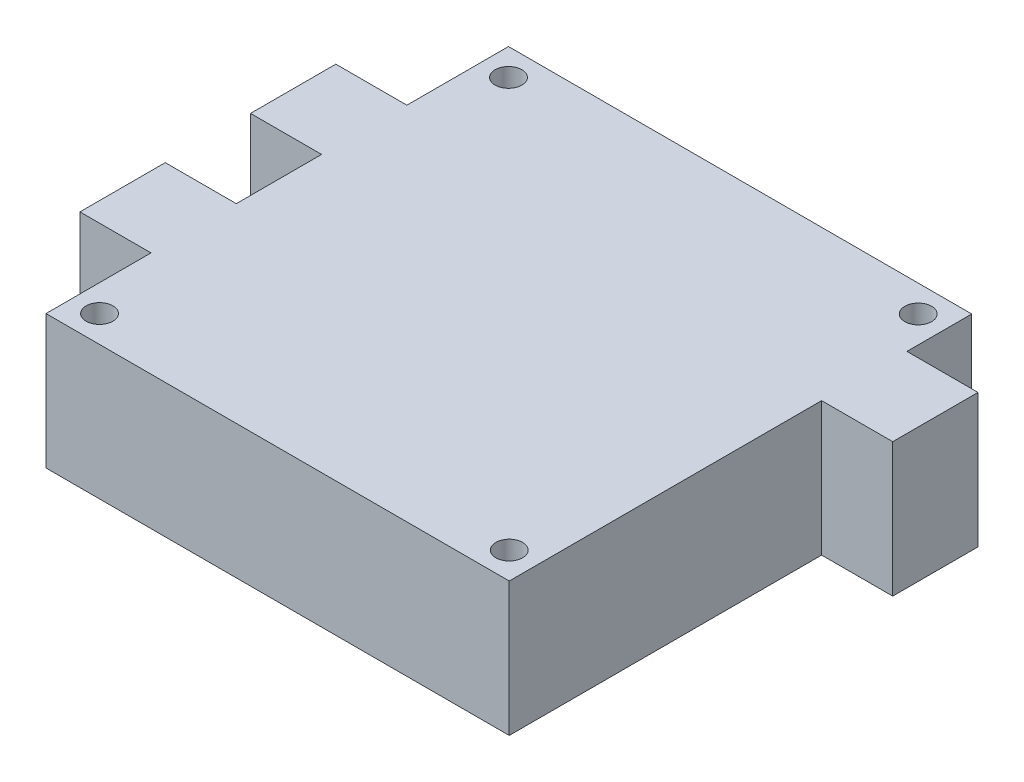
ISO-10303-21;
HEADER;
FILE_DESCRIPTION(('STEP AP214'),'2;1');
FILE_NAME('part.step','',(''),(''),'','','');
FILE_SCHEMA(('AUTOMOTIVE_DESIGN { 1 0 10303 214 1 1 1 1 }'));
ENDSEC;
DATA;
#1=APPLICATION_CONTEXT('core data for automotive mechanical design processes');
#2=APPLICATION_PROTOCOL_DEFINITION('international standard','automotive_design',2000,#1);
#3=PRODUCT_CONTEXT('',#1,'mechanical');
#4=PRODUCT('Part','Part','',(#3));
#5=PRODUCT_RELATED_PRODUCT_CATEGORY('part','',(#4));
#6=PRODUCT_DEFINITION_FORMATION('','',#4);
#7=PRODUCT_DEFINITION_CONTEXT('part definition',#1,'design');
#8=PRODUCT_DEFINITION('design','',#6,#7);
#9=PRODUCT_DEFINITION_SHAPE('','',#8);
#10=(LENGTH_UNIT() NAMED_UNIT(*) SI_UNIT(.MILLI.,.METRE.));
#11=(NAMED_UNIT(*) PLANE_ANGLE_UNIT() SI_UNIT($,.RADIAN.));
#12=(NAMED_UNIT(*) SI_UNIT($,.STERADIAN.) SOLID_ANGLE_UNIT());
#13=UNCERTAINTY_MEASURE_WITH_UNIT(LENGTH_MEASURE(1.E-05),#10,'distance_accuracy_value','');
#14=(GEOMETRIC_REPRESENTATION_CONTEXT(3) GLOBAL_UNCERTAINTY_ASSIGNED_CONTEXT((#13)) GLOBAL_UNIT_ASSIGNED_CONTEXT((#10,
#11,#12)) REPRESENTATION_CONTEXT('',''));
#15=CARTESIAN_POINT('',(0.,0.,0.));
#16=DIRECTION('',(0.,0.,1.));
#17=DIRECTION('',(1.,0.,0.));
#18=AXIS2_PLACEMENT_3D('',#15,#16,#17);
#19=CARTESIAN_POINT('',(0.,16.,0.));
#20=DIRECTION('',(0.,1.,0.));
#21=DIRECTION('',(0.,0.,1.));
#22=AXIS2_PLACEMENT_3D('',#19,#20,#21);
#23=PLANE('',#22);
#24=CARTESIAN_POINT('',(-24.5,16.,24.455));
#25=DIRECTION('',(0.,1.,0.));
#26=DIRECTION('',(0.,0.,1.));
#27=AXIS2_PLACEMENT_3D('',#24,#25,#26);
#28=CIRCLE('',#27,1.6);
#29=CARTESIAN_POINT('',(-24.5,16.,26.055));
#30=VERTEX_POINT('',#29);
#31=EDGE_CURVE('E346',#30,#30,#28,.T.);
#32=ORIENTED_EDGE('',*,*,#31,.F.);
#33=EDGE_LOOP('',(#32));
#34=FACE_BOUND('',#33,.T.);
#35=CARTESIAN_POINT('',(-24.5,16.,-24.455));
#36=DIRECTION('',(0.,1.,0.));
#37=DIRECTION('',(0.,0.,1.));
#38=AXIS2_PLACEMENT_3D('',#35,#36,#37);
#39=CIRCLE('',#38,1.6);
#40=CARTESIAN_POINT('',(-24.5,16.,-22.855));
#41=VERTEX_POINT('',#40);
#42=EDGE_CURVE('E185',#41,#41,#39,.T.);
#43=ORIENTED_EDGE('',*,*,#42,.F.);
#44=EDGE_LOOP('',(#43));
#45=FACE_BOUND('',#44,.T.);
#46=DIRECTION('',(0.,0.,-1.));
#47=VECTOR('',#46,1.);
#48=CARTESIAN_POINT('',(27.7,16.,-9.705));
#49=LINE('',#48,#47);
#50=CARTESIAN_POINT('',(27.7,16.,27.655));
#51=VERTEX_POINT('',#50);
#52=CARTESIAN_POINT('',(27.7,16.,-9.705));
#53=VERTEX_POINT('',#52);
#54=EDGE_CURVE('E212',#51,#53,#49,.T.);
#55=ORIENTED_EDGE('',*,*,#54,.T.);
#56=DIRECTION('',(1.,0.,0.));
#57=VECTOR('',#56,1.);
#58=CARTESIAN_POINT('',(27.7,16.,-9.705));
#59=LINE('',#58,#57);
#60=CARTESIAN_POINT('',(36.2,16.,-9.705));
#61=VERTEX_POINT('',#60);
#62=EDGE_CURVE('E120',#53,#61,#59,.T.);
#63=ORIENTED_EDGE('',*,*,#62,.T.);
#64=DIRECTION('',(0.,0.,-1.));
#65=VECTOR('',#64,1.);
#66=CARTESIAN_POINT('',(36.2,16.,-19.905));
#67=LINE('',#66,#65);
#68=CARTESIAN_POINT('',(36.2,16.,-19.905));
#69=VERTEX_POINT('',#68);
#70=EDGE_CURVE('E251',#61,#69,#67,.T.);
#71=ORIENTED_EDGE('',*,*,#70,.T.);
#72=DIRECTION('',(-1.,0.,0.));
#73=VECTOR('',#72,1.);
#74=CARTESIAN_POINT('',(27.7,16.,-19.905));
#75=LINE('',#74,#73);
#76=CARTESIAN_POINT('',(27.7,16.,-19.905));
#77=VERTEX_POINT('',#76);
#78=EDGE_CURVE('E270',#69,#77,#75,.T.);
#79=ORIENTED_EDGE('',*,*,#78,.T.);
#80=DIRECTION('',(0.,0.,-1.));
#81=VECTOR('',#80,1.);
#82=CARTESIAN_POINT('',(27.7,16.,-27.655));
#83=LINE('',#82,#81);
#84=CARTESIAN_POINT('',(27.7,16.,-27.655));
#85=VERTEX_POINT('',#84);
#86=EDGE_CURVE('E267',#77,#85,#83,.T.);
#87=ORIENTED_EDGE('',*,*,#86,.T.);
#88=DIRECTION('',(-1.,0.,0.));
#89=VECTOR('',#88,1.);
#90=CARTESIAN_POINT('',(-27.7,16.,-27.655));
#91=LINE('',#90,#89);
#92=CARTESIAN_POINT('',(-27.7,16.,-27.655));
#93=VERTEX_POINT('',#92);
#94=EDGE_CURVE('E269',#85,#93,#91,.T.);
#95=ORIENTED_EDGE('',*,*,#94,.T.);
#96=DIRECTION('',(0.,0.,1.));
#97=VECTOR('',#96,1.);
#98=CARTESIAN_POINT('',(-27.7,16.,-27.655));
#99=LINE('',#98,#97);
#100=CARTESIAN_POINT('',(-27.7,16.,-15.505));
#101=VERTEX_POINT('',#100);
#102=EDGE_CURVE('E272',#93,#101,#99,.T.);
#103=ORIENTED_EDGE('',*,*,#102,.T.);
#104=DIRECTION('',(-1.,0.,0.));
#105=VECTOR('',#104,1.);
#106=CARTESIAN_POINT('',(-27.7,16.,-15.505));
#107=LINE('',#106,#105);
#108=CARTESIAN_POINT('',(-36.2,16.,-15.505));
#109=VERTEX_POINT('',#108);
#110=EDGE_CURVE('E278',#101,#109,#107,.T.);
#111=ORIENTED_EDGE('',*,*,#110,.T.);
#112=DIRECTION('',(0.,0.,1.));
#113=VECTOR('',#112,1.);
#114=CARTESIAN_POINT('',(-36.2,16.,-15.505));
#115=LINE('',#114,#113);
#116=CARTESIAN_POINT('',(-36.2,16.,-5.305));
#117=VERTEX_POINT('',#116);
#118=EDGE_CURVE('E280',#109,#117,#115,.T.);
#119=ORIENTED_EDGE('',*,*,#118,.T.);
#120=DIRECTION('',(1.,0.,0.));
#121=VECTOR('',#120,1.);
#122=CARTESIAN_POINT('',(-27.7,16.,-5.305));
#123=LINE('',#122,#121);
#124=CARTESIAN_POINT('',(-27.7,16.,-5.305));
#125=VERTEX_POINT('',#124);
#126=EDGE_CURVE('E282',#117,#125,#123,.T.);
#127=ORIENTED_EDGE('',*,*,#126,.T.);
#128=DIRECTION('',(0.,0.,1.));
#129=VECTOR('',#128,1.);
#130=CARTESIAN_POINT('',(-27.7,16.,-5.305));
#131=LINE('',#130,#129);
#132=CARTESIAN_POINT('',(-27.7,16.,4.895));
#133=VERTEX_POINT('',#132);
#134=EDGE_CURVE('E284',#125,#133,#131,.T.);
#135=ORIENTED_EDGE('',*,*,#134,.T.);
#136=DIRECTION('',(-1.,0.,0.));
#137=VECTOR('',#136,1.);
#138=CARTESIAN_POINT('',(-27.7,16.,4.895));
#139=LINE('',#138,#137);
#140=CARTESIAN_POINT('',(-36.2,16.,4.895));
#141=VERTEX_POINT('',#140);
#142=EDGE_CURVE('E286',#133,#141,#139,.T.);
#143=ORIENTED_EDGE('',*,*,#142,.T.);
#144=DIRECTION('',(0.,0.,1.));
#145=VECTOR('',#144,1.);
#146=CARTESIAN_POINT('',(-36.2,16.,4.895));
#147=LINE('',#146,#145);
#148=CARTESIAN_POINT('',(-36.2,16.,15.095));
#149=VERTEX_POINT('',#148);
#150=EDGE_CURVE('E163',#141,#149,#147,.T.);
#151=ORIENTED_EDGE('',*,*,#150,.T.);
#152=DIRECTION('',(1.,0.,0.));
#153=VECTOR('',#152,1.);
#154=CARTESIAN_POINT('',(-27.7,16.,15.095));
#155=LINE('',#154,#153);
#156=CARTESIAN_POINT('',(-27.7,16.,15.095));
#157=VERTEX_POINT('',#156);
#158=EDGE_CURVE('E157',#149,#157,#155,.T.);
#159=ORIENTED_EDGE('',*,*,#158,.T.);
#160=DIRECTION('',(0.,0.,1.));
#161=VECTOR('',#160,1.);
#162=CARTESIAN_POINT('',(-27.7,16.,15.095));
#163=LINE('',#162,#161);
#164=CARTESIAN_POINT('',(-27.7,16.,27.655));
#165=VERTEX_POINT('',#164);
#166=EDGE_CURVE('E161',#157,#165,#163,.T.);
#167=ORIENTED_EDGE('',*,*,#166,.T.);
#168=DIRECTION('',(1.,0.,0.));
#169=VECTOR('',#168,1.);
#170=CARTESIAN_POINT('',(-27.7,16.,27.655));
#171=LINE('',#170,#169);
#172=EDGE_CURVE('E53',#165,#51,#171,.T.);
#173=ORIENTED_EDGE('',*,*,#172,.T.);
#174=EDGE_LOOP('',(#55,#63,#71,#79,#87,#95,#103,#111,#119,#127,#135,#143,#151,#159,#167,#173));
#175=FACE_BOUND('',#174,.T.);
#176=CARTESIAN_POINT('',(24.5,16.,-24.455));
#177=DIRECTION('',(0.,1.,0.));
#178=DIRECTION('',(0.,0.,1.));
#179=AXIS2_PLACEMENT_3D('',#176,#177,#178);
#180=CIRCLE('',#179,1.6);
#181=CARTESIAN_POINT('',(24.5,16.,-22.855));
#182=VERTEX_POINT('',#181);
#183=EDGE_CURVE('E352',#182,#182,#180,.T.);
#184=ORIENTED_EDGE('',*,*,#183,.F.);
#185=EDGE_LOOP('',(#184));
#186=FACE_BOUND('',#185,.T.);
#187=CARTESIAN_POINT('',(24.5,16.,24.455));
#188=DIRECTION('',(0.,1.,0.));
#189=DIRECTION('',(0.,0.,1.));
#190=AXIS2_PLACEMENT_3D('',#187,#188,#189);
#191=CIRCLE('',#190,1.6);
#192=CARTESIAN_POINT('',(24.5,16.,26.055));
#193=VERTEX_POINT('',#192);
#194=EDGE_CURVE('E337',#193,#193,#191,.T.);
#195=ORIENTED_EDGE('',*,*,#194,.F.);
#196=EDGE_LOOP('',(#195));
#197=FACE_BOUND('',#196,.T.);
#198=ADVANCED_FACE('F36',(#34,#45,#175,#186,#197),#23,.T.);
#199=CARTESIAN_POINT('',(0.,0.,0.));
#200=DIRECTION('',(0.,1.,0.));
#201=DIRECTION('',(0.,0.,1.));
#202=AXIS2_PLACEMENT_3D('',#199,#200,#201);
#203=PLANE('',#202);
#204=DIRECTION('',(0.,0.,-1.));
#205=VECTOR('',#204,1.);
#206=CARTESIAN_POINT('',(27.7,0.,-9.705));
#207=LINE('',#206,#205);
#208=CARTESIAN_POINT('',(27.7,0.,27.655));
#209=VERTEX_POINT('',#208);
#210=CARTESIAN_POINT('',(27.7,0.,-9.705));
#211=VERTEX_POINT('',#210);
#212=EDGE_CURVE('E181',#209,#211,#207,.T.);
#213=ORIENTED_EDGE('',*,*,#212,.F.);
#214=DIRECTION('',(1.,0.,0.));
#215=VECTOR('',#214,1.);
#216=CARTESIAN_POINT('',(-27.7,0.,27.655));
#217=LINE('',#216,#215);
#218=CARTESIAN_POINT('',(-27.7,0.,27.655));
#219=VERTEX_POINT('',#218);
#220=EDGE_CURVE('E112',#219,#209,#217,.T.);
#221=ORIENTED_EDGE('',*,*,#220,.F.);
#222=DIRECTION('',(0.,0.,1.));
#223=VECTOR('',#222,1.);
#224=CARTESIAN_POINT('',(-27.7,0.,15.095));
#225=LINE('',#224,#223);
#226=CARTESIAN_POINT('',(-27.7,0.,15.095));
#227=VERTEX_POINT('',#226);
#228=EDGE_CURVE('E106',#227,#219,#225,.T.);
#229=ORIENTED_EDGE('',*,*,#228,.F.);
#230=DIRECTION('',(1.,0.,0.));
#231=VECTOR('',#230,1.);
#232=CARTESIAN_POINT('',(-27.7,0.,15.095));
#233=LINE('',#232,#231);
#234=CARTESIAN_POINT('',(-36.2,0.,15.095));
#235=VERTEX_POINT('',#234);
#236=EDGE_CURVE('E171',#235,#227,#233,.T.);
#237=ORIENTED_EDGE('',*,*,#236,.F.);
#238=DIRECTION('',(0.,0.,1.));
#239=VECTOR('',#238,1.);
#240=CARTESIAN_POINT('',(-36.2,0.,4.895));
#241=LINE('',#240,#239);
#242=CARTESIAN_POINT('',(-36.2,0.,4.895));
#243=VERTEX_POINT('',#242);
#244=EDGE_CURVE('E207',#243,#235,#241,.T.);
#245=ORIENTED_EDGE('',*,*,#244,.F.);
#246=DIRECTION('',(-1.,0.,0.));
#247=VECTOR('',#246,1.);
#248=CARTESIAN_POINT('',(-27.7,0.,4.895));
#249=LINE('',#248,#247);
#250=CARTESIAN_POINT('',(-27.7,0.,4.895));
#251=VERTEX_POINT('',#250);
#252=EDGE_CURVE('E205',#251,#243,#249,.T.);
#253=ORIENTED_EDGE('',*,*,#252,.F.);
#254=DIRECTION('',(0.,0.,1.));
#255=VECTOR('',#254,1.);
#256=CARTESIAN_POINT('',(-27.7,0.,-5.305));
#257=LINE('',#256,#255);
#258=CARTESIAN_POINT('',(-27.7,0.,-5.305));
#259=VERTEX_POINT('',#258);
#260=EDGE_CURVE('E203',#259,#251,#257,.T.);
#261=ORIENTED_EDGE('',*,*,#260,.F.);
#262=DIRECTION('',(1.,0.,0.));
#263=VECTOR('',#262,1.);
#264=CARTESIAN_POINT('',(-27.7,0.,-5.305));
#265=LINE('',#264,#263);
#266=CARTESIAN_POINT('',(-36.2,0.,-5.305));
#267=VERTEX_POINT('',#266);
#268=EDGE_CURVE('E201',#267,#259,#265,.T.);
#269=ORIENTED_EDGE('',*,*,#268,.F.);
#270=DIRECTION('',(0.,0.,1.));
#271=VECTOR('',#270,1.);
#272=CARTESIAN_POINT('',(-36.2,0.,-15.505));
#273=LINE('',#272,#271);
#274=CARTESIAN_POINT('',(-36.2,0.,-15.505));
#275=VERTEX_POINT('',#274);
#276=EDGE_CURVE('E199',#275,#267,#273,.T.);
#277=ORIENTED_EDGE('',*,*,#276,.F.);
#278=DIRECTION('',(-1.,0.,0.));
#279=VECTOR('',#278,1.);
#280=CARTESIAN_POINT('',(-27.7,0.,-15.505));
#281=LINE('',#280,#279);
#282=CARTESIAN_POINT('',(-27.7,0.,-15.505));
#283=VERTEX_POINT('',#282);
#284=EDGE_CURVE('E197',#283,#275,#281,.T.);
#285=ORIENTED_EDGE('',*,*,#284,.F.);
#286=DIRECTION('',(0.,0.,1.));
#287=VECTOR('',#286,1.);
#288=CARTESIAN_POINT('',(-27.7,0.,-27.655));
#289=LINE('',#288,#287);
#290=CARTESIAN_POINT('',(-27.7,0.,-27.655));
#291=VERTEX_POINT('',#290);
#292=EDGE_CURVE('E195',#291,#283,#289,.T.);
#293=ORIENTED_EDGE('',*,*,#292,.F.);
#294=DIRECTION('',(-1.,0.,0.));
#295=VECTOR('',#294,1.);
#296=CARTESIAN_POINT('',(-27.7,0.,-27.655));
#297=LINE('',#296,#295);
#298=CARTESIAN_POINT('',(27.7,0.,-27.655));
#299=VERTEX_POINT('',#298);
#300=EDGE_CURVE('E193',#299,#291,#297,.T.);
#301=ORIENTED_EDGE('',*,*,#300,.F.);
#302=DIRECTION('',(0.,0.,-1.));
#303=VECTOR('',#302,1.);
#304=CARTESIAN_POINT('',(27.7,0.,-27.655));
#305=LINE('',#304,#303);
#306=CARTESIAN_POINT('',(27.7,0.,-19.905));
#307=VERTEX_POINT('',#306);
#308=EDGE_CURVE('E191',#307,#299,#305,.T.);
#309=ORIENTED_EDGE('',*,*,#308,.F.);
#310=DIRECTION('',(-1.,0.,0.));
#311=VECTOR('',#310,1.);
#312=CARTESIAN_POINT('',(27.7,0.,-19.905));
#313=LINE('',#312,#311);
#314=CARTESIAN_POINT('',(36.2,0.,-19.905));
#315=VERTEX_POINT('',#314);
#316=EDGE_CURVE('E189',#315,#307,#313,.T.);
#317=ORIENTED_EDGE('',*,*,#316,.F.);
#318=DIRECTION('',(0.,0.,-1.));
#319=VECTOR('',#318,1.);
#320=CARTESIAN_POINT('',(36.2,0.,-19.905));
#321=LINE('',#320,#319);
#322=CARTESIAN_POINT('',(36.2,0.,-9.705));
#323=VERTEX_POINT('',#322);
#324=EDGE_CURVE('E187',#323,#315,#321,.T.);
#325=ORIENTED_EDGE('',*,*,#324,.F.);
#326=DIRECTION('',(1.,0.,0.));
#327=VECTOR('',#326,1.);
#328=CARTESIAN_POINT('',(27.7,0.,-9.705));
#329=LINE('',#328,#327);
#330=EDGE_CURVE('E184',#211,#323,#329,.T.);
#331=ORIENTED_EDGE('',*,*,#330,.F.);
#332=EDGE_LOOP('',(#213,#221,#229,#237,#245,#253,#261,#269,#277,#285,#293,#301,#309,#317,#325,#331));
#333=FACE_BOUND('',#332,.T.);
#334=CARTESIAN_POINT('',(-24.5,0.,-24.455));
#335=DIRECTION('',(0.,1.,0.));
#336=DIRECTION('',(0.,0.,1.));
#337=AXIS2_PLACEMENT_3D('',#334,#335,#336);
#338=CIRCLE('',#337,1.6);
#339=CARTESIAN_POINT('',(-24.5,0.,-22.855));
#340=VERTEX_POINT('',#339);
#341=EDGE_CURVE('E355',#340,#340,#338,.T.);
#342=ORIENTED_EDGE('',*,*,#341,.T.);
#343=EDGE_LOOP('',(#342));
#344=FACE_BOUND('',#343,.T.);
#345=CARTESIAN_POINT('',(24.5,0.,-24.455));
#346=DIRECTION('',(0.,1.,0.));
#347=DIRECTION('',(0.,0.,1.));
#348=AXIS2_PLACEMENT_3D('',#345,#346,#347);
#349=CIRCLE('',#348,1.6);
#350=CARTESIAN_POINT('',(24.5,0.,-22.855));
#351=VERTEX_POINT('',#350);
#352=EDGE_CURVE('E349',#351,#351,#349,.T.);
#353=ORIENTED_EDGE('',*,*,#352,.T.);
#354=EDGE_LOOP('',(#353));
#355=FACE_BOUND('',#354,.T.);
#356=CARTESIAN_POINT('',(-24.5,0.,24.455));
#357=DIRECTION('',(0.,1.,0.));
#358=DIRECTION('',(0.,0.,1.));
#359=AXIS2_PLACEMENT_3D('',#356,#357,#358);
#360=CIRCLE('',#359,1.6);
#361=CARTESIAN_POINT('',(-24.5,0.,26.055));
#362=VERTEX_POINT('',#361);
#363=EDGE_CURVE('E343',#362,#362,#360,.T.);
#364=ORIENTED_EDGE('',*,*,#363,.T.);
#365=EDGE_LOOP('',(#364));
#366=FACE_BOUND('',#365,.T.);
#367=CARTESIAN_POINT('',(24.5,0.,24.455));
#368=DIRECTION('',(0.,1.,0.));
#369=DIRECTION('',(0.,0.,1.));
#370=AXIS2_PLACEMENT_3D('',#367,#368,#369);
#371=CIRCLE('',#370,1.6);
#372=CARTESIAN_POINT('',(24.5,0.,26.055));
#373=VERTEX_POINT('',#372);
#374=EDGE_CURVE('E340',#373,#373,#371,.T.);
#375=ORIENTED_EDGE('',*,*,#374,.T.);
#376=EDGE_LOOP('',(#375));
#377=FACE_BOUND('',#376,.T.);
#378=ADVANCED_FACE('F255',(#333,#344,#355,#366,#377),#203,.F.);
#379=CARTESIAN_POINT('',(27.7,16.,-9.705));
#380=DIRECTION('',(-1.,0.,0.));
#381=DIRECTION('',(0.,0.,1.));
#382=AXIS2_PLACEMENT_3D('',#379,#380,#381);
#383=PLANE('',#382);
#384=ORIENTED_EDGE('',*,*,#212,.T.);
#385=DIRECTION('',(0.,-1.,0.));
#386=VECTOR('',#385,1.);
#387=CARTESIAN_POINT('',(27.7,16.,-9.705));
#388=LINE('',#387,#386);
#389=EDGE_CURVE('E11',#53,#211,#388,.T.);
#390=ORIENTED_EDGE('',*,*,#389,.F.);
#391=ORIENTED_EDGE('',*,*,#54,.F.);
#392=DIRECTION('',(0.,-1.,0.));
#393=VECTOR('',#392,1.);
#394=CARTESIAN_POINT('',(27.7,16.,27.655));
#395=LINE('',#394,#393);
#396=EDGE_CURVE('E177',#51,#209,#395,.T.);
#397=ORIENTED_EDGE('',*,*,#396,.T.);
#398=EDGE_LOOP('',(#384,#390,#391,#397));
#399=FACE_BOUND('',#398,.T.);
#400=ADVANCED_FACE('F38',(#399),#383,.F.);
#401=CARTESIAN_POINT('',(27.7,16.,-9.705));
#402=DIRECTION('',(0.,0.,-1.));
#403=DIRECTION('',(-1.,0.,0.));
#404=AXIS2_PLACEMENT_3D('',#401,#402,#403);
#405=PLANE('',#404);
#406=ORIENTED_EDGE('',*,*,#330,.T.);
#407=DIRECTION('',(0.,-1.,0.));
#408=VECTOR('',#407,1.);
#409=CARTESIAN_POINT('',(36.2,16.,-9.705));
#410=LINE('',#409,#408);
#411=EDGE_CURVE('E45',#61,#323,#410,.T.);
#412=ORIENTED_EDGE('',*,*,#411,.F.);
#413=ORIENTED_EDGE('',*,*,#62,.F.);
#414=ORIENTED_EDGE('',*,*,#389,.T.);
#415=EDGE_LOOP('',(#406,#412,#413,#414));
#416=FACE_BOUND('',#415,.T.);
#417=ADVANCED_FACE('F505',(#416),#405,.F.);
#418=CARTESIAN_POINT('',(36.2,16.,-19.905));
#419=DIRECTION('',(-1.,0.,0.));
#420=DIRECTION('',(0.,0.,1.));
#421=AXIS2_PLACEMENT_3D('',#418,#419,#420);
#422=PLANE('',#421);
#423=ORIENTED_EDGE('',*,*,#324,.T.);
#424=DIRECTION('',(0.,-1.,0.));
#425=VECTOR('',#424,1.);
#426=CARTESIAN_POINT('',(36.2,16.,-19.905));
#427=LINE('',#426,#425);
#428=EDGE_CURVE('E243',#69,#315,#427,.T.);
#429=ORIENTED_EDGE('',*,*,#428,.F.);
#430=ORIENTED_EDGE('',*,*,#70,.F.);
#431=ORIENTED_EDGE('',*,*,#411,.T.);
#432=EDGE_LOOP('',(#423,#429,#430,#431));
#433=FACE_BOUND('',#432,.T.);
#434=ADVANCED_FACE('F249',(#433),#422,.F.);
#435=CARTESIAN_POINT('',(27.7,16.,-19.905));
#436=DIRECTION('',(0.,0.,1.));
#437=DIRECTION('',(1.,0.,0.));
#438=AXIS2_PLACEMENT_3D('',#435,#436,#437);
#439=PLANE('',#438);
#440=ORIENTED_EDGE('',*,*,#316,.T.);
#441=DIRECTION('',(0.,-1.,0.));
#442=VECTOR('',#441,1.);
#443=CARTESIAN_POINT('',(27.7,16.,-19.905));
#444=LINE('',#443,#442);
#445=EDGE_CURVE('E240',#77,#307,#444,.T.);
#446=ORIENTED_EDGE('',*,*,#445,.F.);
#447=ORIENTED_EDGE('',*,*,#78,.F.);
#448=ORIENTED_EDGE('',*,*,#428,.T.);
#449=EDGE_LOOP('',(#440,#446,#447,#448));
#450=FACE_BOUND('',#449,.T.);
#451=ADVANCED_FACE('F261',(#450),#439,.F.);
#452=CARTESIAN_POINT('',(27.7,16.,-27.655));
#453=DIRECTION('',(-1.,0.,0.));
#454=DIRECTION('',(0.,0.,1.));
#455=AXIS2_PLACEMENT_3D('',#452,#453,#454);
#456=PLANE('',#455);
#457=ORIENTED_EDGE('',*,*,#308,.T.);
#458=DIRECTION('',(0.,-1.,0.));
#459=VECTOR('',#458,1.);
#460=CARTESIAN_POINT('',(27.7,16.,-27.655));
#461=LINE('',#460,#459);
#462=EDGE_CURVE('E237',#85,#299,#461,.T.);
#463=ORIENTED_EDGE('',*,*,#462,.F.);
#464=ORIENTED_EDGE('',*,*,#86,.F.);
#465=ORIENTED_EDGE('',*,*,#445,.T.);
#466=EDGE_LOOP('',(#457,#463,#464,#465));
#467=FACE_BOUND('',#466,.T.);
#468=ADVANCED_FACE('F265',(#467),#456,.F.);
#469=CARTESIAN_POINT('',(-27.7,16.,-27.655));
#470=DIRECTION('',(0.,0.,1.));
#471=DIRECTION('',(1.,0.,0.));
#472=AXIS2_PLACEMENT_3D('',#469,#470,#471);
#473=PLANE('',#472);
#474=ORIENTED_EDGE('',*,*,#300,.T.);
#475=DIRECTION('',(0.,-1.,0.));
#476=VECTOR('',#475,1.);
#477=CARTESIAN_POINT('',(-27.7,16.,-27.655));
#478=LINE('',#477,#476);
#479=EDGE_CURVE('E234',#93,#291,#478,.T.);
#480=ORIENTED_EDGE('',*,*,#479,.F.);
#481=ORIENTED_EDGE('',*,*,#94,.F.);
#482=ORIENTED_EDGE('',*,*,#462,.T.);
#483=EDGE_LOOP('',(#474,#480,#481,#482));
#484=FACE_BOUND('',#483,.T.);
#485=ADVANCED_FACE('F470',(#484),#473,.F.);
#486=CARTESIAN_POINT('',(-27.7,16.,-27.655));
#487=DIRECTION('',(1.,0.,0.));
#488=DIRECTION('',(0.,0.,-1.));
#489=AXIS2_PLACEMENT_3D('',#486,#487,#488);
#490=PLANE('',#489);
#491=ORIENTED_EDGE('',*,*,#292,.T.);
#492=DIRECTION('',(0.,-1.,0.));
#493=VECTOR('',#492,1.);
#494=CARTESIAN_POINT('',(-27.7,16.,-15.505));
#495=LINE('',#494,#493);
#496=EDGE_CURVE('E231',#101,#283,#495,.T.);
#497=ORIENTED_EDGE('',*,*,#496,.F.);
#498=ORIENTED_EDGE('',*,*,#102,.F.);
#499=ORIENTED_EDGE('',*,*,#479,.T.);
#500=EDGE_LOOP('',(#491,#497,#498,#499));
#501=FACE_BOUND('',#500,.T.);
#502=ADVANCED_FACE('F460',(#501),#490,.F.);
#503=CARTESIAN_POINT('',(-27.7,16.,-15.505));
#504=DIRECTION('',(0.,0.,1.));
#505=DIRECTION('',(1.,0.,0.));
#506=AXIS2_PLACEMENT_3D('',#503,#504,#505);
#507=PLANE('',#506);
#508=ORIENTED_EDGE('',*,*,#284,.T.);
#509=DIRECTION('',(0.,-1.,0.));
#510=VECTOR('',#509,1.);
#511=CARTESIAN_POINT('',(-36.2,16.,-15.505));
#512=LINE('',#511,#510);
#513=EDGE_CURVE('E228',#109,#275,#512,.T.);
#514=ORIENTED_EDGE('',*,*,#513,.F.);
#515=ORIENTED_EDGE('',*,*,#110,.F.);
#516=ORIENTED_EDGE('',*,*,#496,.T.);
#517=EDGE_LOOP('',(#508,#514,#515,#516));
#518=FACE_BOUND('',#517,.T.);
#519=ADVANCED_FACE('F450',(#518),#507,.F.);
#520=CARTESIAN_POINT('',(-36.2,16.,-15.505));
#521=DIRECTION('',(1.,0.,0.));
#522=DIRECTION('',(0.,0.,-1.));
#523=AXIS2_PLACEMENT_3D('',#520,#521,#522);
#524=PLANE('',#523);
#525=ORIENTED_EDGE('',*,*,#276,.T.);
#526=DIRECTION('',(0.,-1.,0.));
#527=VECTOR('',#526,1.);
#528=CARTESIAN_POINT('',(-36.2,16.,-5.305));
#529=LINE('',#528,#527);
#530=EDGE_CURVE('E225',#117,#267,#529,.T.);
#531=ORIENTED_EDGE('',*,*,#530,.F.);
#532=ORIENTED_EDGE('',*,*,#118,.F.);
#533=ORIENTED_EDGE('',*,*,#513,.T.);
#534=EDGE_LOOP('',(#525,#531,#532,#533));
#535=FACE_BOUND('',#534,.T.);
#536=ADVANCED_FACE('F440',(#535),#524,.F.);
#537=CARTESIAN_POINT('',(-27.7,16.,-5.305));
#538=DIRECTION('',(0.,0.,-1.));
#539=DIRECTION('',(-1.,0.,0.));
#540=AXIS2_PLACEMENT_3D('',#537,#538,#539);
#541=PLANE('',#540);
#542=ORIENTED_EDGE('',*,*,#268,.T.);
#543=DIRECTION('',(0.,-1.,0.));
#544=VECTOR('',#543,1.);
#545=CARTESIAN_POINT('',(-27.7,16.,-5.305));
#546=LINE('',#545,#544);
#547=EDGE_CURVE('E222',#125,#259,#546,.T.);
#548=ORIENTED_EDGE('',*,*,#547,.F.);
#549=ORIENTED_EDGE('',*,*,#126,.F.);
#550=ORIENTED_EDGE('',*,*,#530,.T.);
#551=EDGE_LOOP('',(#542,#548,#549,#550));
#552=FACE_BOUND('',#551,.T.);
#553=ADVANCED_FACE('F430',(#552),#541,.F.);
#554=CARTESIAN_POINT('',(-27.7,16.,-5.305));
#555=DIRECTION('',(1.,0.,0.));
#556=DIRECTION('',(0.,0.,-1.));
#557=AXIS2_PLACEMENT_3D('',#554,#555,#556);
#558=PLANE('',#557);
#559=ORIENTED_EDGE('',*,*,#260,.T.);
#560=DIRECTION('',(0.,-1.,0.));
#561=VECTOR('',#560,1.);
#562=CARTESIAN_POINT('',(-27.7,16.,4.895));
#563=LINE('',#562,#561);
#564=EDGE_CURVE('E219',#133,#251,#563,.T.);
#565=ORIENTED_EDGE('',*,*,#564,.F.);
#566=ORIENTED_EDGE('',*,*,#134,.F.);
#567=ORIENTED_EDGE('',*,*,#547,.T.);
#568=EDGE_LOOP('',(#559,#565,#566,#567));
#569=FACE_BOUND('',#568,.T.);
#570=ADVANCED_FACE('F421',(#569),#558,.F.);
#571=CARTESIAN_POINT('',(-27.7,16.,4.895));
#572=DIRECTION('',(0.,0.,1.));
#573=DIRECTION('',(1.,0.,0.));
#574=AXIS2_PLACEMENT_3D('',#571,#572,#573);
#575=PLANE('',#574);
#576=ORIENTED_EDGE('',*,*,#252,.T.);
#577=DIRECTION('',(0.,-1.,0.));
#578=VECTOR('',#577,1.);
#579=CARTESIAN_POINT('',(-36.2,16.,4.895));
#580=LINE('',#579,#578);
#581=EDGE_CURVE('E216',#141,#243,#580,.T.);
#582=ORIENTED_EDGE('',*,*,#581,.F.);
#583=ORIENTED_EDGE('',*,*,#142,.F.);
#584=ORIENTED_EDGE('',*,*,#564,.T.);
#585=EDGE_LOOP('',(#576,#582,#583,#584));
#586=FACE_BOUND('',#585,.T.);
#587=ADVANCED_FACE('F292',(#586),#575,.F.);
#588=CARTESIAN_POINT('',(-36.2,16.,4.895));
#589=DIRECTION('',(1.,0.,0.));
#590=DIRECTION('',(0.,0.,-1.));
#591=AXIS2_PLACEMENT_3D('',#588,#589,#590);
#592=PLANE('',#591);
#593=ORIENTED_EDGE('',*,*,#244,.T.);
#594=DIRECTION('',(0.,-1.,0.));
#595=VECTOR('',#594,1.);
#596=CARTESIAN_POINT('',(-36.2,16.,15.095));
#597=LINE('',#596,#595);
#598=EDGE_CURVE('E172',#149,#235,#597,.T.);
#599=ORIENTED_EDGE('',*,*,#598,.F.);
#600=ORIENTED_EDGE('',*,*,#150,.F.);
#601=ORIENTED_EDGE('',*,*,#581,.T.);
#602=EDGE_LOOP('',(#593,#599,#600,#601));
#603=FACE_BOUND('',#602,.T.);
#604=ADVANCED_FACE('F296',(#603),#592,.F.);
#605=CARTESIAN_POINT('',(-27.7,16.,15.095));
#606=DIRECTION('',(0.,0.,-1.));
#607=DIRECTION('',(-1.,0.,0.));
#608=AXIS2_PLACEMENT_3D('',#605,#606,#607);
#609=PLANE('',#608);
#610=ORIENTED_EDGE('',*,*,#236,.T.);
#611=DIRECTION('',(0.,-1.,0.));
#612=VECTOR('',#611,1.);
#613=CARTESIAN_POINT('',(-27.7,16.,15.095));
#614=LINE('',#613,#612);
#615=EDGE_CURVE('E168',#157,#227,#614,.T.);
#616=ORIENTED_EDGE('',*,*,#615,.F.);
#617=ORIENTED_EDGE('',*,*,#158,.F.);
#618=ORIENTED_EDGE('',*,*,#598,.T.);
#619=EDGE_LOOP('',(#610,#616,#617,#618));
#620=FACE_BOUND('',#619,.T.);
#621=ADVANCED_FACE('F169',(#620),#609,.F.);
#622=CARTESIAN_POINT('',(-27.7,16.,15.095));
#623=DIRECTION('',(1.,0.,0.));
#624=DIRECTION('',(0.,0.,-1.));
#625=AXIS2_PLACEMENT_3D('',#622,#623,#624);
#626=PLANE('',#625);
#627=ORIENTED_EDGE('',*,*,#228,.T.);
#628=DIRECTION('',(0.,-1.,0.));
#629=VECTOR('',#628,1.);
#630=CARTESIAN_POINT('',(-27.7,16.,27.655));
#631=LINE('',#630,#629);
#632=EDGE_CURVE('E173',#165,#219,#631,.T.);
#633=ORIENTED_EDGE('',*,*,#632,.F.);
#634=ORIENTED_EDGE('',*,*,#166,.F.);
#635=ORIENTED_EDGE('',*,*,#615,.T.);
#636=EDGE_LOOP('',(#627,#633,#634,#635));
#637=FACE_BOUND('',#636,.T.);
#638=ADVANCED_FACE('F175',(#637),#626,.F.);
#639=CARTESIAN_POINT('',(-27.7,16.,27.655));
#640=DIRECTION('',(0.,0.,-1.));
#641=DIRECTION('',(-1.,0.,0.));
#642=AXIS2_PLACEMENT_3D('',#639,#640,#641);
#643=PLANE('',#642);
#644=ORIENTED_EDGE('',*,*,#220,.T.);
#645=ORIENTED_EDGE('',*,*,#396,.F.);
#646=ORIENTED_EDGE('',*,*,#172,.F.);
#647=ORIENTED_EDGE('',*,*,#632,.T.);
#648=EDGE_LOOP('',(#644,#645,#646,#647));
#649=FACE_BOUND('',#648,.T.);
#650=ADVANCED_FACE('F300',(#649),#643,.F.);
#651=CARTESIAN_POINT('',(-24.5,16.,-24.455));
#652=DIRECTION('',(0.,-1.,0.));
#653=DIRECTION('',(0.,0.,-1.));
#654=AXIS2_PLACEMENT_3D('',#651,#652,#653);
#655=CYLINDRICAL_SURFACE('',#654,1.6);
#656=ORIENTED_EDGE('',*,*,#42,.T.);
#657=EDGE_LOOP('',(#656));
#658=FACE_BOUND('',#657,.T.);
#659=ORIENTED_EDGE('',*,*,#341,.F.);
#660=EDGE_LOOP('',(#659));
#661=FACE_BOUND('',#660,.T.);
#662=ADVANCED_FACE('F302',(#658,#661),#655,.F.);
#663=CARTESIAN_POINT('',(24.5,16.,-24.455));
#664=DIRECTION('',(0.,-1.,0.));
#665=DIRECTION('',(0.,0.,-1.));
#666=AXIS2_PLACEMENT_3D('',#663,#664,#665);
#667=CYLINDRICAL_SURFACE('',#666,1.6);
#668=ORIENTED_EDGE('',*,*,#183,.T.);
#669=EDGE_LOOP('',(#668));
#670=FACE_BOUND('',#669,.T.);
#671=ORIENTED_EDGE('',*,*,#352,.F.);
#672=EDGE_LOOP('',(#671));
#673=FACE_BOUND('',#672,.T.);
#674=ADVANCED_FACE('F308',(#670,#673),#667,.F.);
#675=CARTESIAN_POINT('',(-24.5,16.,24.455));
#676=DIRECTION('',(0.,-1.,0.));
#677=DIRECTION('',(0.,0.,-1.));
#678=AXIS2_PLACEMENT_3D('',#675,#676,#677);
#679=CYLINDRICAL_SURFACE('',#678,1.6);
#680=ORIENTED_EDGE('',*,*,#31,.T.);
#681=EDGE_LOOP('',(#680));
#682=FACE_BOUND('',#681,.T.);
#683=ORIENTED_EDGE('',*,*,#363,.F.);
#684=EDGE_LOOP('',(#683));
#685=FACE_BOUND('',#684,.T.);
#686=ADVANCED_FACE('F324',(#682,#685),#679,.F.);
#687=CARTESIAN_POINT('',(24.5,16.,24.455));
#688=DIRECTION('',(0.,-1.,0.));
#689=DIRECTION('',(0.,0.,-1.));
#690=AXIS2_PLACEMENT_3D('',#687,#688,#689);
#691=CYLINDRICAL_SURFACE('',#690,1.6);
#692=ORIENTED_EDGE('',*,*,#194,.T.);
#693=EDGE_LOOP('',(#692));
#694=FACE_BOUND('',#693,.T.);
#695=ORIENTED_EDGE('',*,*,#374,.F.);
#696=EDGE_LOOP('',(#695));
#697=FACE_BOUND('',#696,.T.);
#698=ADVANCED_FACE('F328',(#694,#697),#691,.F.);
#699=CLOSED_SHELL('',(#198,#378,#400,#417,#434,#451,#468,#485,#502,#519,#536,#553,#570,#587,
#604,#621,#638,#650,#662,#674,#686,#698));
#700=MANIFOLD_SOLID_BREP('B2',#699);
#701=ADVANCED_BREP_SHAPE_REPRESENTATION('',(#18,#700),#14);
#702=SHAPE_DEFINITION_REPRESENTATION(#9,#701);
ENDSEC;
END-ISO-10303-21;
